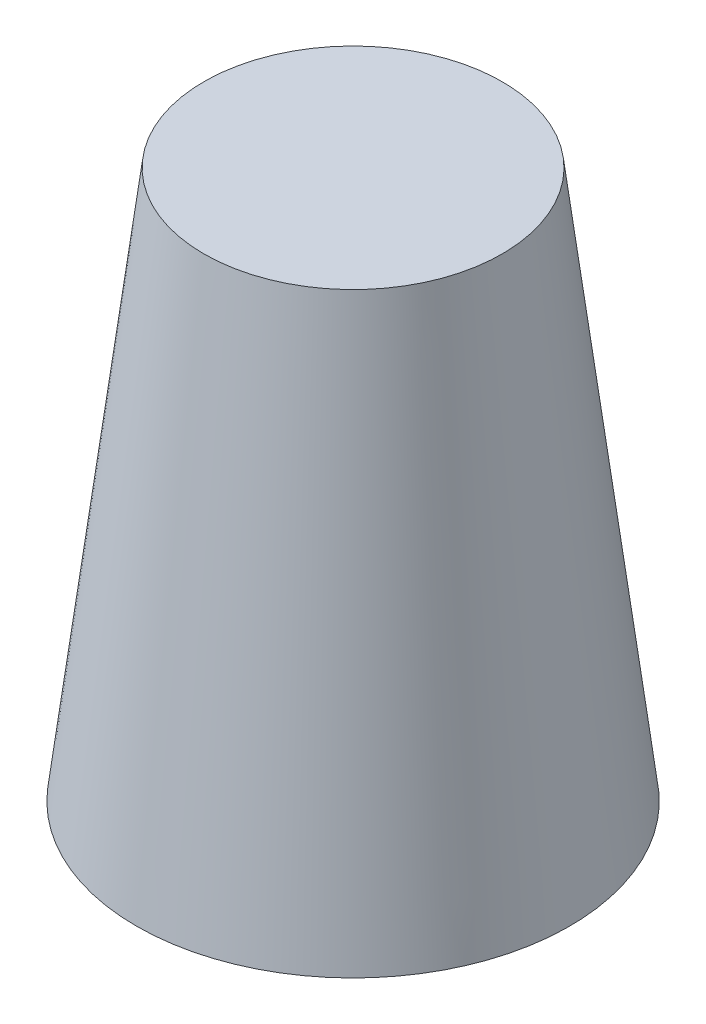
ISO-10303-21;
HEADER;
FILE_DESCRIPTION(('STEP AP214'),'2;1');
FILE_NAME('part.step','',(''),(''),'','','');
FILE_SCHEMA(('AUTOMOTIVE_DESIGN { 1 0 10303 214 1 1 1 1 }'));
ENDSEC;
DATA;
#1=APPLICATION_CONTEXT('core data for automotive mechanical design processes');
#2=APPLICATION_PROTOCOL_DEFINITION('international standard','automotive_design',2000,#1);
#3=PRODUCT_CONTEXT('',#1,'mechanical');
#4=PRODUCT('Part','Part','',(#3));
#5=PRODUCT_RELATED_PRODUCT_CATEGORY('part','',(#4));
#6=PRODUCT_DEFINITION_FORMATION('','',#4);
#7=PRODUCT_DEFINITION_CONTEXT('part definition',#1,'design');
#8=PRODUCT_DEFINITION('design','',#6,#7);
#9=PRODUCT_DEFINITION_SHAPE('','',#8);
#10=(LENGTH_UNIT() NAMED_UNIT(*) SI_UNIT(.MILLI.,.METRE.));
#11=(NAMED_UNIT(*) PLANE_ANGLE_UNIT() SI_UNIT($,.RADIAN.));
#12=(NAMED_UNIT(*) SI_UNIT($,.STERADIAN.) SOLID_ANGLE_UNIT());
#13=UNCERTAINTY_MEASURE_WITH_UNIT(LENGTH_MEASURE(1.E-05),#10,'distance_accuracy_value','');
#14=(GEOMETRIC_REPRESENTATION_CONTEXT(3) GLOBAL_UNCERTAINTY_ASSIGNED_CONTEXT((#13)) GLOBAL_UNIT_ASSIGNED_CONTEXT((#10,
#11,#12)) REPRESENTATION_CONTEXT('',''));
#15=CARTESIAN_POINT('',(0.,0.,0.));
#16=DIRECTION('',(0.,0.,1.));
#17=DIRECTION('',(1.,0.,0.));
#18=AXIS2_PLACEMENT_3D('',#15,#16,#17);
#19=CARTESIAN_POINT('',(0.,0.,0.));
#20=DIRECTION('',(0.,-1.,0.));
#21=DIRECTION('',(0.,0.,1.));
#22=AXIS2_PLACEMENT_3D('',#19,#20,#21);
#23=CONICAL_SURFACE('',#22,47.625,0.122173047639603);
#24=CARTESIAN_POINT('',(0.,120.65,0.));
#25=DIRECTION('',(0.,1.,0.));
#26=DIRECTION('',(0.,0.,1.));
#27=AXIS2_PLACEMENT_3D('',#24,#25,#26);
#28=CIRCLE('',#27,32.8110427270646);
#29=CARTESIAN_POINT('',(0.,120.65,32.8110427270646));
#30=VERTEX_POINT('',#29);
#31=EDGE_CURVE('E10',#30,#30,#28,.T.);
#32=ORIENTED_EDGE('',*,*,#31,.F.);
#33=EDGE_LOOP('',(#32));
#34=FACE_BOUND('',#33,.T.);
#35=CARTESIAN_POINT('',(0.,0.,0.));
#36=DIRECTION('',(0.,1.,0.));
#37=DIRECTION('',(0.,0.,1.));
#38=AXIS2_PLACEMENT_3D('',#35,#36,#37);
#39=CIRCLE('',#38,47.625);
#40=CARTESIAN_POINT('',(0.,0.,47.6250000000001));
#41=VERTEX_POINT('',#40);
#42=EDGE_CURVE('E37',#41,#41,#39,.T.);
#43=ORIENTED_EDGE('',*,*,#42,.T.);
#44=EDGE_LOOP('',(#43));
#45=FACE_BOUND('',#44,.T.);
#46=ADVANCED_FACE('F31',(#34,#45),#23,.T.);
#47=CARTESIAN_POINT('',(0.,120.65,0.));
#48=DIRECTION('',(0.,1.,0.));
#49=DIRECTION('',(0.,0.,1.));
#50=AXIS2_PLACEMENT_3D('',#47,#48,#49);
#51=PLANE('',#50);
#52=ORIENTED_EDGE('',*,*,#31,.T.);
#53=EDGE_LOOP('',(#52));
#54=FACE_BOUND('',#53,.T.);
#55=ADVANCED_FACE('F46',(#54),#51,.T.);
#56=CARTESIAN_POINT('',(0.,0.,0.));
#57=DIRECTION('',(0.,1.,0.));
#58=DIRECTION('',(0.,0.,1.));
#59=AXIS2_PLACEMENT_3D('',#56,#57,#58);
#60=PLANE('',#59);
#61=ORIENTED_EDGE('',*,*,#42,.F.);
#62=EDGE_LOOP('',(#61));
#63=FACE_BOUND('',#62,.T.);
#64=ADVANCED_FACE('F44',(#63),#60,.F.);
#65=CLOSED_SHELL('',(#46,#55,#64));
#66=MANIFOLD_SOLID_BREP('B2',#65);
#67=ADVANCED_BREP_SHAPE_REPRESENTATION('',(#18,#66),#14);
#68=SHAPE_DEFINITION_REPRESENTATION(#9,#67);
ENDSEC;
END-ISO-10303-21;
